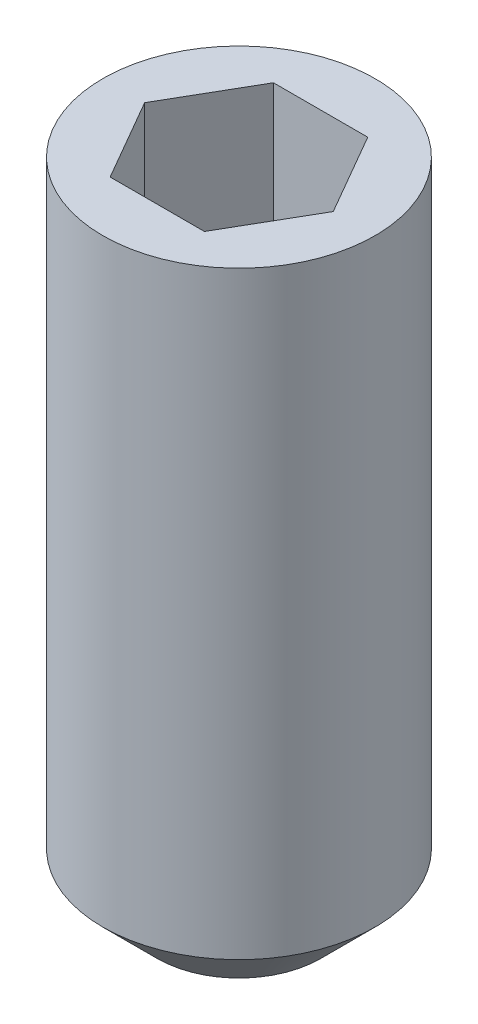
ISO-10303-21;
HEADER;
FILE_DESCRIPTION(('STEP AP214'),'2;1');
FILE_NAME('part.step','',(''),(''),'','','');
FILE_SCHEMA(('AUTOMOTIVE_DESIGN { 1 0 10303 214 1 1 1 1 }'));
ENDSEC;
DATA;
#1=APPLICATION_CONTEXT('core data for automotive mechanical design processes');
#2=APPLICATION_PROTOCOL_DEFINITION('international standard','automotive_design',2000,#1);
#3=PRODUCT_CONTEXT('',#1,'mechanical');
#4=PRODUCT('Part','Part','',(#3));
#5=PRODUCT_RELATED_PRODUCT_CATEGORY('part','',(#4));
#6=PRODUCT_DEFINITION_FORMATION('','',#4);
#7=PRODUCT_DEFINITION_CONTEXT('part definition',#1,'design');
#8=PRODUCT_DEFINITION('design','',#6,#7);
#9=PRODUCT_DEFINITION_SHAPE('','',#8);
#10=(LENGTH_UNIT() NAMED_UNIT(*) SI_UNIT(.MILLI.,.METRE.));
#11=(NAMED_UNIT(*) PLANE_ANGLE_UNIT() SI_UNIT($,.RADIAN.));
#12=(NAMED_UNIT(*) SI_UNIT($,.STERADIAN.) SOLID_ANGLE_UNIT());
#13=UNCERTAINTY_MEASURE_WITH_UNIT(LENGTH_MEASURE(1.E-05),#10,'distance_accuracy_value','');
#14=(GEOMETRIC_REPRESENTATION_CONTEXT(3) GLOBAL_UNCERTAINTY_ASSIGNED_CONTEXT((#13)) GLOBAL_UNIT_ASSIGNED_CONTEXT((#10,
#11,#12)) REPRESENTATION_CONTEXT('',''));
#15=CARTESIAN_POINT('',(0.,0.,0.));
#16=DIRECTION('',(0.,0.,1.));
#17=DIRECTION('',(1.,0.,0.));
#18=AXIS2_PLACEMENT_3D('',#15,#16,#17);
#19=CARTESIAN_POINT('',(0.,6.,0.));
#20=DIRECTION('',(0.,-1.,0.));
#21=DIRECTION('',(0.,0.,-1.));
#22=AXIS2_PLACEMENT_3D('',#19,#20,#21);
#23=CYLINDRICAL_SURFACE('',#22,1.25);
#24=CARTESIAN_POINT('',(0.,0.500000000000002,0.));
#25=DIRECTION('',(0.,1.,0.));
#26=DIRECTION('',(0.,0.,1.));
#27=AXIS2_PLACEMENT_3D('',#24,#25,#26);
#28=CIRCLE('',#27,1.25);
#29=CARTESIAN_POINT('',(0.,0.500000000000002,1.25));
#30=VERTEX_POINT('',#29);
#31=EDGE_CURVE('E40',#30,#30,#28,.T.);
#32=ORIENTED_EDGE('',*,*,#31,.T.);
#33=EDGE_LOOP('',(#32));
#34=FACE_BOUND('',#33,.T.);
#35=CARTESIAN_POINT('',(0.,6.,0.));
#36=DIRECTION('',(0.,1.,0.));
#37=DIRECTION('',(0.,0.,1.));
#38=AXIS2_PLACEMENT_3D('',#35,#36,#37);
#39=CIRCLE('',#38,1.25);
#40=CARTESIAN_POINT('',(0.,6.,1.25));
#41=VERTEX_POINT('',#40);
#42=EDGE_CURVE('E134',#41,#41,#39,.T.);
#43=ORIENTED_EDGE('',*,*,#42,.F.);
#44=EDGE_LOOP('',(#43));
#45=FACE_BOUND('',#44,.T.);
#46=ADVANCED_FACE('F32',(#34,#45),#23,.T.);
#47=CARTESIAN_POINT('',(0.,6.,0.));
#48=DIRECTION('',(0.,1.,0.));
#49=DIRECTION('',(0.,0.,1.));
#50=AXIS2_PLACEMENT_3D('',#47,#48,#49);
#51=PLANE('',#50);
#52=DIRECTION('',(1.,0.,0.));
#53=VECTOR('',#52,1.);
#54=CARTESIAN_POINT('',(-0.433012701892219,6.,0.75));
#55=LINE('',#54,#53);
#56=CARTESIAN_POINT('',(-0.433012701892219,6.,0.75));
#57=VERTEX_POINT('',#56);
#58=CARTESIAN_POINT('',(0.43301270189222,6.,0.75));
#59=VERTEX_POINT('',#58);
#60=EDGE_CURVE('E47',#57,#59,#55,.T.);
#61=ORIENTED_EDGE('',*,*,#60,.F.);
#62=DIRECTION('',(0.5,0.,0.866025403784439));
#63=VECTOR('',#62,1.);
#64=CARTESIAN_POINT('',(-0.866025403784439,6.,0.));
#65=LINE('',#64,#63);
#66=CARTESIAN_POINT('',(-0.866025403784439,6.,0.));
#67=VERTEX_POINT('',#66);
#68=EDGE_CURVE('E130',#67,#57,#65,.T.);
#69=ORIENTED_EDGE('',*,*,#68,.F.);
#70=DIRECTION('',(-0.5,0.,0.866025403784439));
#71=VECTOR('',#70,1.);
#72=CARTESIAN_POINT('',(-0.433012701892219,6.,-0.75));
#73=LINE('',#72,#71);
#74=CARTESIAN_POINT('',(-0.433012701892219,6.,-0.75));
#75=VERTEX_POINT('',#74);
#76=EDGE_CURVE('E128',#75,#67,#73,.T.);
#77=ORIENTED_EDGE('',*,*,#76,.F.);
#78=DIRECTION('',(-1.,0.,0.));
#79=VECTOR('',#78,1.);
#80=CARTESIAN_POINT('',(0.433012701892219,6.,-0.75));
#81=LINE('',#80,#79);
#82=CARTESIAN_POINT('',(0.433012701892219,6.,-0.75));
#83=VERTEX_POINT('',#82);
#84=EDGE_CURVE('E95',#83,#75,#81,.T.);
#85=ORIENTED_EDGE('',*,*,#84,.F.);
#86=DIRECTION('',(-0.5,0.,-0.866025403784439));
#87=VECTOR('',#86,1.);
#88=CARTESIAN_POINT('',(0.866025403784438,6.,0.));
#89=LINE('',#88,#87);
#90=CARTESIAN_POINT('',(0.866025403784438,6.,0.));
#91=VERTEX_POINT('',#90);
#92=EDGE_CURVE('E124',#91,#83,#89,.T.);
#93=ORIENTED_EDGE('',*,*,#92,.F.);
#94=DIRECTION('',(0.5,0.,-0.866025403784439));
#95=VECTOR('',#94,1.);
#96=CARTESIAN_POINT('',(0.433012701892219,6.,0.75));
#97=LINE('',#96,#95);
#98=EDGE_CURVE('E121',#59,#91,#97,.T.);
#99=ORIENTED_EDGE('',*,*,#98,.F.);
#100=EDGE_LOOP('',(#61,#69,#77,#85,#93,#99));
#101=FACE_BOUND('',#100,.T.);
#102=ORIENTED_EDGE('',*,*,#42,.T.);
#103=EDGE_LOOP('',(#102));
#104=FACE_BOUND('',#103,.T.);
#105=ADVANCED_FACE('F156',(#101,#104),#51,.T.);
#106=CARTESIAN_POINT('',(0.,0.,0.));
#107=DIRECTION('',(0.,1.,0.));
#108=DIRECTION('',(0.,0.,1.));
#109=AXIS2_PLACEMENT_3D('',#106,#107,#108);
#110=PLANE('',#109);
#111=CARTESIAN_POINT('',(0.,0.,0.));
#112=DIRECTION('',(0.,1.,0.));
#113=DIRECTION('',(0.,0.,1.));
#114=AXIS2_PLACEMENT_3D('',#111,#112,#113);
#115=CIRCLE('',#114,0.749999999999996);
#116=CARTESIAN_POINT('',(0.,0.,0.749999999999996));
#117=VERTEX_POINT('',#116);
#118=EDGE_CURVE('E11',#117,#117,#115,.F.);
#119=ORIENTED_EDGE('',*,*,#118,.T.);
#120=EDGE_LOOP('',(#119));
#121=FACE_BOUND('',#120,.T.);
#122=ADVANCED_FACE('F148',(#121),#110,.F.);
#123=CARTESIAN_POINT('',(0.,0.500000000000002,0.));
#124=DIRECTION('',(0.,1.,0.));
#125=DIRECTION('',(0.,0.,1.));
#126=AXIS2_PLACEMENT_3D('',#123,#124,#125);
#127=CONICAL_SURFACE('',#126,1.25,0.78539816339745);
#128=ORIENTED_EDGE('',*,*,#118,.F.);
#129=EDGE_LOOP('',(#128));
#130=FACE_BOUND('',#129,.T.);
#131=ORIENTED_EDGE('',*,*,#31,.F.);
#132=EDGE_LOOP('',(#131));
#133=FACE_BOUND('',#132,.T.);
#134=ADVANCED_FACE('F34',(#130,#133),#127,.T.);
#135=CARTESIAN_POINT('',(-0.433012701892219,4.5,0.75));
#136=DIRECTION('',(0.,0.,1.));
#137=DIRECTION('',(1.,0.,0.));
#138=AXIS2_PLACEMENT_3D('',#135,#136,#137);
#139=PLANE('',#138);
#140=ORIENTED_EDGE('',*,*,#60,.T.);
#141=DIRECTION('',(0.,1.,0.));
#142=VECTOR('',#141,1.);
#143=CARTESIAN_POINT('',(0.433012701892219,4.5,0.75));
#144=LINE('',#143,#142);
#145=CARTESIAN_POINT('',(0.433012701892219,4.5,0.75));
#146=VERTEX_POINT('',#145);
#147=EDGE_CURVE('E77',#146,#59,#144,.T.);
#148=ORIENTED_EDGE('',*,*,#147,.F.);
#149=DIRECTION('',(1.,0.,0.));
#150=VECTOR('',#149,1.);
#151=CARTESIAN_POINT('',(-0.433012701892219,4.5,0.75));
#152=LINE('',#151,#150);
#153=CARTESIAN_POINT('',(-0.433012701892219,4.5,0.75));
#154=VERTEX_POINT('',#153);
#155=EDGE_CURVE('E132',#154,#146,#152,.T.);
#156=ORIENTED_EDGE('',*,*,#155,.F.);
#157=DIRECTION('',(0.,1.,0.));
#158=VECTOR('',#157,1.);
#159=CARTESIAN_POINT('',(-0.433012701892219,4.5,0.75));
#160=LINE('',#159,#158);
#161=EDGE_CURVE('E55',#154,#57,#160,.T.);
#162=ORIENTED_EDGE('',*,*,#161,.T.);
#163=EDGE_LOOP('',(#140,#148,#156,#162));
#164=FACE_BOUND('',#163,.T.);
#165=ADVANCED_FACE('F147',(#164),#139,.F.);
#166=CARTESIAN_POINT('',(-0.866025403784439,4.5,0.));
#167=DIRECTION('',(-0.866025403784439,0.,0.5));
#168=DIRECTION('',(0.5,0.,0.866025403784439));
#169=AXIS2_PLACEMENT_3D('',#166,#167,#168);
#170=PLANE('',#169);
#171=ORIENTED_EDGE('',*,*,#68,.T.);
#172=ORIENTED_EDGE('',*,*,#161,.F.);
#173=DIRECTION('',(0.5,0.,0.866025403784439));
#174=VECTOR('',#173,1.);
#175=CARTESIAN_POINT('',(-0.866025403784439,4.5,0.));
#176=LINE('',#175,#174);
#177=CARTESIAN_POINT('',(-0.866025403784439,4.5,0.));
#178=VERTEX_POINT('',#177);
#179=EDGE_CURVE('E107',#178,#154,#176,.T.);
#180=ORIENTED_EDGE('',*,*,#179,.F.);
#181=DIRECTION('',(0.,1.,0.));
#182=VECTOR('',#181,1.);
#183=CARTESIAN_POINT('',(-0.866025403784439,4.5,0.));
#184=LINE('',#183,#182);
#185=EDGE_CURVE('E99',#178,#67,#184,.T.);
#186=ORIENTED_EDGE('',*,*,#185,.T.);
#187=EDGE_LOOP('',(#171,#172,#180,#186));
#188=FACE_BOUND('',#187,.T.);
#189=ADVANCED_FACE('F154',(#188),#170,.F.);
#190=CARTESIAN_POINT('',(-0.433012701892219,4.5,-0.75));
#191=DIRECTION('',(-0.866025403784439,0.,-0.5));
#192=DIRECTION('',(-0.5,0.,0.866025403784439));
#193=AXIS2_PLACEMENT_3D('',#190,#191,#192);
#194=PLANE('',#193);
#195=ORIENTED_EDGE('',*,*,#76,.T.);
#196=ORIENTED_EDGE('',*,*,#185,.F.);
#197=DIRECTION('',(-0.5,0.,0.866025403784439));
#198=VECTOR('',#197,1.);
#199=CARTESIAN_POINT('',(-0.433012701892219,4.5,-0.75));
#200=LINE('',#199,#198);
#201=CARTESIAN_POINT('',(-0.433012701892219,4.5,-0.75));
#202=VERTEX_POINT('',#201);
#203=EDGE_CURVE('E103',#202,#178,#200,.T.);
#204=ORIENTED_EDGE('',*,*,#203,.F.);
#205=DIRECTION('',(0.,1.,0.));
#206=VECTOR('',#205,1.);
#207=CARTESIAN_POINT('',(-0.433012701892219,4.5,-0.75));
#208=LINE('',#207,#206);
#209=EDGE_CURVE('E88',#202,#75,#208,.T.);
#210=ORIENTED_EDGE('',*,*,#209,.T.);
#211=EDGE_LOOP('',(#195,#196,#204,#210));
#212=FACE_BOUND('',#211,.T.);
#213=ADVANCED_FACE('F104',(#212),#194,.F.);
#214=CARTESIAN_POINT('',(0.433012701892219,4.5,-0.75));
#215=DIRECTION('',(0.,0.,-1.));
#216=DIRECTION('',(-1.,0.,0.));
#217=AXIS2_PLACEMENT_3D('',#214,#215,#216);
#218=PLANE('',#217);
#219=ORIENTED_EDGE('',*,*,#84,.T.);
#220=ORIENTED_EDGE('',*,*,#209,.F.);
#221=DIRECTION('',(-1.,0.,0.));
#222=VECTOR('',#221,1.);
#223=CARTESIAN_POINT('',(0.433012701892219,4.5,-0.75));
#224=LINE('',#223,#222);
#225=CARTESIAN_POINT('',(0.433012701892219,4.5,-0.75));
#226=VERTEX_POINT('',#225);
#227=EDGE_CURVE('E92',#226,#202,#224,.T.);
#228=ORIENTED_EDGE('',*,*,#227,.F.);
#229=DIRECTION('',(0.,1.,0.));
#230=VECTOR('',#229,1.);
#231=CARTESIAN_POINT('',(0.433012701892219,4.5,-0.75));
#232=LINE('',#231,#230);
#233=EDGE_CURVE('E100',#226,#83,#232,.T.);
#234=ORIENTED_EDGE('',*,*,#233,.T.);
#235=EDGE_LOOP('',(#219,#220,#228,#234));
#236=FACE_BOUND('',#235,.T.);
#237=ADVANCED_FACE('F90',(#236),#218,.F.);
#238=CARTESIAN_POINT('',(0.866025403784438,4.5,0.));
#239=DIRECTION('',(0.866025403784438,0.,-0.5));
#240=DIRECTION('',(-0.5,0.,-0.866025403784439));
#241=AXIS2_PLACEMENT_3D('',#238,#239,#240);
#242=PLANE('',#241);
#243=ORIENTED_EDGE('',*,*,#92,.T.);
#244=ORIENTED_EDGE('',*,*,#233,.F.);
#245=DIRECTION('',(-0.5,0.,-0.866025403784439));
#246=VECTOR('',#245,1.);
#247=CARTESIAN_POINT('',(0.866025403784438,4.5,0.));
#248=LINE('',#247,#246);
#249=CARTESIAN_POINT('',(0.866025403784438,4.5,0.));
#250=VERTEX_POINT('',#249);
#251=EDGE_CURVE('E113',#250,#226,#248,.T.);
#252=ORIENTED_EDGE('',*,*,#251,.F.);
#253=DIRECTION('',(0.,1.,0.));
#254=VECTOR('',#253,1.);
#255=CARTESIAN_POINT('',(0.866025403784438,4.5,0.));
#256=LINE('',#255,#254);
#257=EDGE_CURVE('E137',#250,#91,#256,.T.);
#258=ORIENTED_EDGE('',*,*,#257,.T.);
#259=EDGE_LOOP('',(#243,#244,#252,#258));
#260=FACE_BOUND('',#259,.T.);
#261=ADVANCED_FACE('F170',(#260),#242,.F.);
#262=CARTESIAN_POINT('',(0.433012701892219,4.5,0.75));
#263=DIRECTION('',(0.866025403784439,0.,0.5));
#264=DIRECTION('',(0.5,0.,-0.866025403784439));
#265=AXIS2_PLACEMENT_3D('',#262,#263,#264);
#266=PLANE('',#265);
#267=ORIENTED_EDGE('',*,*,#98,.T.);
#268=ORIENTED_EDGE('',*,*,#257,.F.);
#269=DIRECTION('',(0.5,0.,-0.866025403784439));
#270=VECTOR('',#269,1.);
#271=CARTESIAN_POINT('',(0.433012701892219,4.5,0.75));
#272=LINE('',#271,#270);
#273=EDGE_CURVE('E115',#146,#250,#272,.T.);
#274=ORIENTED_EDGE('',*,*,#273,.F.);
#275=ORIENTED_EDGE('',*,*,#147,.T.);
#276=EDGE_LOOP('',(#267,#268,#274,#275));
#277=FACE_BOUND('',#276,.T.);
#278=ADVANCED_FACE('F167',(#277),#266,.F.);
#279=CARTESIAN_POINT('',(0.,4.5,0.));
#280=DIRECTION('',(0.,1.,0.));
#281=DIRECTION('',(0.,0.,1.));
#282=AXIS2_PLACEMENT_3D('',#279,#280,#281);
#283=PLANE('',#282);
#284=ORIENTED_EDGE('',*,*,#155,.T.);
#285=ORIENTED_EDGE('',*,*,#273,.T.);
#286=ORIENTED_EDGE('',*,*,#251,.T.);
#287=ORIENTED_EDGE('',*,*,#227,.T.);
#288=ORIENTED_EDGE('',*,*,#203,.T.);
#289=ORIENTED_EDGE('',*,*,#179,.T.);
#290=EDGE_LOOP('',(#284,#285,#286,#287,#288,#289));
#291=FACE_BOUND('',#290,.T.);
#292=ADVANCED_FACE('F110',(#291),#283,.T.);
#293=CLOSED_SHELL('',(#46,#105,#122,#134,#165,#189,#213,#237,#261,#278,#292));
#294=MANIFOLD_SOLID_BREP('B2',#293);
#295=ADVANCED_BREP_SHAPE_REPRESENTATION('',(#18,#294),#14);
#296=SHAPE_DEFINITION_REPRESENTATION(#9,#295);
ENDSEC;
END-ISO-10303-21;
